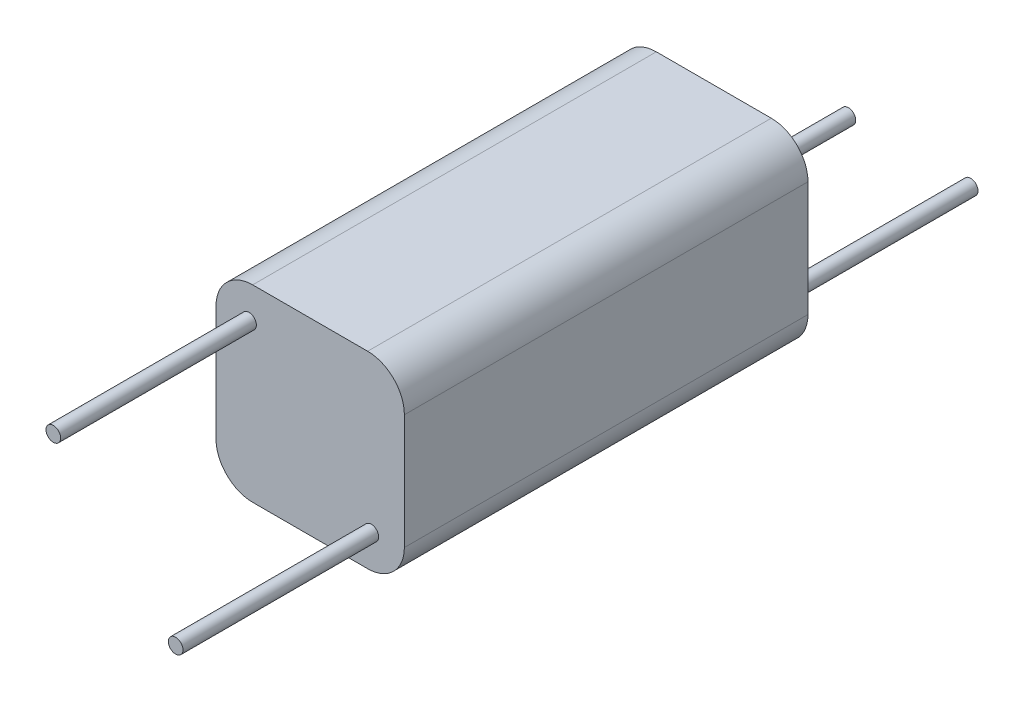
ISO-10303-21;
HEADER;
FILE_DESCRIPTION(('STEP AP214'),'2;1');
FILE_NAME('part.step','',(''),(''),'','','');
FILE_SCHEMA(('AUTOMOTIVE_DESIGN { 1 0 10303 214 1 1 1 1 }'));
ENDSEC;
DATA;
#1=APPLICATION_CONTEXT('core data for automotive mechanical design processes');
#2=APPLICATION_PROTOCOL_DEFINITION('international standard','automotive_design',2000,#1);
#3=PRODUCT_CONTEXT('',#1,'mechanical');
#4=PRODUCT('Part','Part','',(#3));
#5=PRODUCT_RELATED_PRODUCT_CATEGORY('part','',(#4));
#6=PRODUCT_DEFINITION_FORMATION('','',#4);
#7=PRODUCT_DEFINITION_CONTEXT('part definition',#1,'design');
#8=PRODUCT_DEFINITION('design','',#6,#7);
#9=PRODUCT_DEFINITION_SHAPE('','',#8);
#10=(LENGTH_UNIT() NAMED_UNIT(*) SI_UNIT(.MILLI.,.METRE.));
#11=(NAMED_UNIT(*) PLANE_ANGLE_UNIT() SI_UNIT($,.RADIAN.));
#12=(NAMED_UNIT(*) SI_UNIT($,.STERADIAN.) SOLID_ANGLE_UNIT());
#13=UNCERTAINTY_MEASURE_WITH_UNIT(LENGTH_MEASURE(1.E-05),#10,'distance_accuracy_value','');
#14=(GEOMETRIC_REPRESENTATION_CONTEXT(3) GLOBAL_UNCERTAINTY_ASSIGNED_CONTEXT((#13)) GLOBAL_UNIT_ASSIGNED_CONTEXT((#10,
#11,#12)) REPRESENTATION_CONTEXT('',''));
#15=CARTESIAN_POINT('',(0.,0.,0.));
#16=DIRECTION('',(0.,0.,1.));
#17=DIRECTION('',(1.,0.,0.));
#18=AXIS2_PLACEMENT_3D('',#15,#16,#17);
#19=CARTESIAN_POINT('',(-2.35,-2.35,16.5));
#20=DIRECTION('',(0.,0.,1.));
#21=DIRECTION('',(1.,0.,0.));
#22=AXIS2_PLACEMENT_3D('',#19,#20,#21);
#23=PLANE('',#22);
#24=CARTESIAN_POINT('',(2.5,-2.5,16.5));
#25=DIRECTION('',(0.,0.,1.));
#26=DIRECTION('',(1.,0.,0.));
#27=AXIS2_PLACEMENT_3D('',#24,#25,#26);
#28=CIRCLE('',#27,0.3);
#29=CARTESIAN_POINT('',(2.8,-2.5,16.5));
#30=VERTEX_POINT('',#29);
#31=EDGE_CURVE('E244',#30,#30,#28,.T.);
#32=ORIENTED_EDGE('',*,*,#31,.F.);
#33=EDGE_LOOP('',(#32));
#34=FACE_BOUND('',#33,.T.);
#35=CARTESIAN_POINT('',(-2.35,-2.35,16.5));
#36=DIRECTION('',(0.,0.,1.));
#37=DIRECTION('',(1.,0.,0.));
#38=AXIS2_PLACEMENT_3D('',#35,#36,#37);
#39=CIRCLE('',#38,1.5);
#40=CARTESIAN_POINT('',(-3.85,-2.35,16.5));
#41=VERTEX_POINT('',#40);
#42=CARTESIAN_POINT('',(-2.35,-3.85,16.5));
#43=VERTEX_POINT('',#42);
#44=EDGE_CURVE('E146',#41,#43,#39,.T.);
#45=ORIENTED_EDGE('',*,*,#44,.T.);
#46=DIRECTION('',(1.,0.,0.));
#47=VECTOR('',#46,1.);
#48=CARTESIAN_POINT('',(-2.35,-3.85,16.5));
#49=LINE('',#48,#47);
#50=CARTESIAN_POINT('',(2.35,-3.85,16.5));
#51=VERTEX_POINT('',#50);
#52=EDGE_CURVE('E94',#43,#51,#49,.T.);
#53=ORIENTED_EDGE('',*,*,#52,.T.);
#54=CARTESIAN_POINT('',(2.35,-2.35,16.5));
#55=DIRECTION('',(0.,0.,1.));
#56=DIRECTION('',(1.,0.,0.));
#57=AXIS2_PLACEMENT_3D('',#54,#55,#56);
#58=CIRCLE('',#57,1.5);
#59=CARTESIAN_POINT('',(3.85,-2.35,16.5));
#60=VERTEX_POINT('',#59);
#61=EDGE_CURVE('E227',#51,#60,#58,.T.);
#62=ORIENTED_EDGE('',*,*,#61,.T.);
#63=DIRECTION('',(0.,1.,0.));
#64=VECTOR('',#63,1.);
#65=CARTESIAN_POINT('',(3.85,-2.35,16.5));
#66=LINE('',#65,#64);
#67=CARTESIAN_POINT('',(3.85,2.35,16.5));
#68=VERTEX_POINT('',#67);
#69=EDGE_CURVE('E232',#60,#68,#66,.T.);
#70=ORIENTED_EDGE('',*,*,#69,.T.);
#71=CARTESIAN_POINT('',(2.35,2.35,16.5));
#72=DIRECTION('',(0.,0.,1.));
#73=DIRECTION('',(-1.,0.,0.));
#74=AXIS2_PLACEMENT_3D('',#71,#72,#73);
#75=CIRCLE('',#74,1.5);
#76=CARTESIAN_POINT('',(2.35,3.85,16.5));
#77=VERTEX_POINT('',#76);
#78=EDGE_CURVE('E113',#68,#77,#75,.T.);
#79=ORIENTED_EDGE('',*,*,#78,.T.);
#80=DIRECTION('',(-1.,0.,0.));
#81=VECTOR('',#80,1.);
#82=CARTESIAN_POINT('',(-2.35,3.85,16.5));
#83=LINE('',#82,#81);
#84=CARTESIAN_POINT('',(-2.35,3.85,16.5));
#85=VERTEX_POINT('',#84);
#86=EDGE_CURVE('E107',#77,#85,#83,.T.);
#87=ORIENTED_EDGE('',*,*,#86,.T.);
#88=CARTESIAN_POINT('',(-2.35,2.35,16.5));
#89=DIRECTION('',(0.,0.,1.));
#90=DIRECTION('',(1.,0.,0.));
#91=AXIS2_PLACEMENT_3D('',#88,#89,#90);
#92=CIRCLE('',#91,1.5);
#93=CARTESIAN_POINT('',(-3.85,2.35,16.5));
#94=VERTEX_POINT('',#93);
#95=EDGE_CURVE('E111',#85,#94,#92,.T.);
#96=ORIENTED_EDGE('',*,*,#95,.T.);
#97=DIRECTION('',(0.,-1.,0.));
#98=VECTOR('',#97,1.);
#99=CARTESIAN_POINT('',(-3.85,-2.35,16.5));
#100=LINE('',#99,#98);
#101=EDGE_CURVE('E50',#94,#41,#100,.T.);
#102=ORIENTED_EDGE('',*,*,#101,.T.);
#103=EDGE_LOOP('',(#45,#53,#62,#70,#79,#87,#96,#102));
#104=FACE_BOUND('',#103,.T.);
#105=CARTESIAN_POINT('',(-2.5,2.5,16.5));
#106=DIRECTION('',(0.,0.,1.));
#107=DIRECTION('',(1.,0.,0.));
#108=AXIS2_PLACEMENT_3D('',#105,#106,#107);
#109=CIRCLE('',#108,0.3);
#110=CARTESIAN_POINT('',(-2.2,2.5,16.5));
#111=VERTEX_POINT('',#110);
#112=EDGE_CURVE('E250',#111,#111,#109,.T.);
#113=ORIENTED_EDGE('',*,*,#112,.F.);
#114=EDGE_LOOP('',(#113));
#115=FACE_BOUND('',#114,.T.);
#116=ADVANCED_FACE('F33',(#34,#104,#115),#23,.T.);
#117=CARTESIAN_POINT('',(-2.35,-2.35,0.));
#118=DIRECTION('',(0.,0.,1.));
#119=DIRECTION('',(1.,0.,0.));
#120=AXIS2_PLACEMENT_3D('',#117,#118,#119);
#121=PLANE('',#120);
#122=CARTESIAN_POINT('',(2.5,-2.5,0.));
#123=DIRECTION('',(0.,0.,1.));
#124=DIRECTION('',(1.,0.,0.));
#125=AXIS2_PLACEMENT_3D('',#122,#123,#124);
#126=CIRCLE('',#125,0.3);
#127=CARTESIAN_POINT('',(2.8,-2.5,0.));
#128=VERTEX_POINT('',#127);
#129=EDGE_CURVE('E42',#128,#128,#126,.F.);
#130=ORIENTED_EDGE('',*,*,#129,.F.);
#131=EDGE_LOOP('',(#130));
#132=FACE_BOUND('',#131,.T.);
#133=CARTESIAN_POINT('',(-2.35,-2.35,0.));
#134=DIRECTION('',(0.,0.,1.));
#135=DIRECTION('',(1.,0.,0.));
#136=AXIS2_PLACEMENT_3D('',#133,#134,#135);
#137=CIRCLE('',#136,1.5);
#138=CARTESIAN_POINT('',(-3.85,-2.35,0.));
#139=VERTEX_POINT('',#138);
#140=CARTESIAN_POINT('',(-2.35,-3.85,0.));
#141=VERTEX_POINT('',#140);
#142=EDGE_CURVE('E131',#139,#141,#137,.T.);
#143=ORIENTED_EDGE('',*,*,#142,.F.);
#144=DIRECTION('',(0.,-1.,0.));
#145=VECTOR('',#144,1.);
#146=CARTESIAN_POINT('',(-3.85,-2.35,0.));
#147=LINE('',#146,#145);
#148=CARTESIAN_POINT('',(-3.85,2.35,0.));
#149=VERTEX_POINT('',#148);
#150=EDGE_CURVE('E85',#149,#139,#147,.T.);
#151=ORIENTED_EDGE('',*,*,#150,.F.);
#152=CARTESIAN_POINT('',(-2.35,2.35,0.));
#153=DIRECTION('',(0.,0.,1.));
#154=DIRECTION('',(1.,0.,0.));
#155=AXIS2_PLACEMENT_3D('',#152,#153,#154);
#156=CIRCLE('',#155,1.5);
#157=CARTESIAN_POINT('',(-2.35,3.85,0.));
#158=VERTEX_POINT('',#157);
#159=EDGE_CURVE('E79',#158,#149,#156,.T.);
#160=ORIENTED_EDGE('',*,*,#159,.F.);
#161=DIRECTION('',(-1.,0.,0.));
#162=VECTOR('',#161,1.);
#163=CARTESIAN_POINT('',(-2.35,3.85,0.));
#164=LINE('',#163,#162);
#165=CARTESIAN_POINT('',(2.35,3.85,0.));
#166=VERTEX_POINT('',#165);
#167=EDGE_CURVE('E121',#166,#158,#164,.T.);
#168=ORIENTED_EDGE('',*,*,#167,.F.);
#169=CARTESIAN_POINT('',(2.35,2.35,0.));
#170=DIRECTION('',(0.,0.,1.));
#171=DIRECTION('',(-1.,0.,0.));
#172=AXIS2_PLACEMENT_3D('',#169,#170,#171);
#173=CIRCLE('',#172,1.5);
#174=CARTESIAN_POINT('',(3.85,2.35,0.));
#175=VERTEX_POINT('',#174);
#176=EDGE_CURVE('E141',#175,#166,#173,.T.);
#177=ORIENTED_EDGE('',*,*,#176,.F.);
#178=DIRECTION('',(0.,1.,0.));
#179=VECTOR('',#178,1.);
#180=CARTESIAN_POINT('',(3.85,-2.35,0.));
#181=LINE('',#180,#179);
#182=CARTESIAN_POINT('',(3.85,-2.35,0.));
#183=VERTEX_POINT('',#182);
#184=EDGE_CURVE('E139',#183,#175,#181,.T.);
#185=ORIENTED_EDGE('',*,*,#184,.F.);
#186=CARTESIAN_POINT('',(2.35,-2.35,0.));
#187=DIRECTION('',(0.,0.,1.));
#188=DIRECTION('',(1.,0.,0.));
#189=AXIS2_PLACEMENT_3D('',#186,#187,#188);
#190=CIRCLE('',#189,1.5);
#191=CARTESIAN_POINT('',(2.35,-3.85,0.));
#192=VERTEX_POINT('',#191);
#193=EDGE_CURVE('E137',#192,#183,#190,.T.);
#194=ORIENTED_EDGE('',*,*,#193,.F.);
#195=DIRECTION('',(1.,0.,0.));
#196=VECTOR('',#195,1.);
#197=CARTESIAN_POINT('',(-2.35,-3.85,0.));
#198=LINE('',#197,#196);
#199=EDGE_CURVE('E134',#141,#192,#198,.T.);
#200=ORIENTED_EDGE('',*,*,#199,.F.);
#201=EDGE_LOOP('',(#143,#151,#160,#168,#177,#185,#194,#200));
#202=FACE_BOUND('',#201,.T.);
#203=CARTESIAN_POINT('',(-2.5,-2.5,0.));
#204=DIRECTION('',(0.,0.,1.));
#205=DIRECTION('',(1.,0.,0.));
#206=AXIS2_PLACEMENT_3D('',#203,#204,#205);
#207=CIRCLE('',#206,0.3);
#208=CARTESIAN_POINT('',(-2.2,-2.5,0.));
#209=VERTEX_POINT('',#208);
#210=EDGE_CURVE('E11',#209,#209,#207,.F.);
#211=ORIENTED_EDGE('',*,*,#210,.F.);
#212=EDGE_LOOP('',(#211));
#213=FACE_BOUND('',#212,.T.);
#214=ADVANCED_FACE('F165',(#132,#202,#213),#121,.F.);
#215=CARTESIAN_POINT('',(-2.35,-2.35,16.5));
#216=DIRECTION('',(0.,0.,-1.));
#217=DIRECTION('',(-1.,0.,0.));
#218=AXIS2_PLACEMENT_3D('',#215,#216,#217);
#219=CYLINDRICAL_SURFACE('',#218,1.5);
#220=ORIENTED_EDGE('',*,*,#142,.T.);
#221=DIRECTION('',(0.,0.,-1.));
#222=VECTOR('',#221,1.);
#223=CARTESIAN_POINT('',(-2.35,-3.85,16.5));
#224=LINE('',#223,#222);
#225=EDGE_CURVE('E159',#43,#141,#224,.T.);
#226=ORIENTED_EDGE('',*,*,#225,.F.);
#227=ORIENTED_EDGE('',*,*,#44,.F.);
#228=DIRECTION('',(0.,0.,-1.));
#229=VECTOR('',#228,1.);
#230=CARTESIAN_POINT('',(-3.85,-2.35,16.5));
#231=LINE('',#230,#229);
#232=EDGE_CURVE('E127',#41,#139,#231,.T.);
#233=ORIENTED_EDGE('',*,*,#232,.T.);
#234=EDGE_LOOP('',(#220,#226,#227,#233));
#235=FACE_BOUND('',#234,.T.);
#236=ADVANCED_FACE('F35',(#235),#219,.T.);
#237=CARTESIAN_POINT('',(-2.35,-3.85,16.5));
#238=DIRECTION('',(0.,1.,0.));
#239=DIRECTION('',(0.,0.,1.));
#240=AXIS2_PLACEMENT_3D('',#237,#238,#239);
#241=PLANE('',#240);
#242=ORIENTED_EDGE('',*,*,#199,.T.);
#243=DIRECTION('',(0.,0.,-1.));
#244=VECTOR('',#243,1.);
#245=CARTESIAN_POINT('',(2.35,-3.85,16.5));
#246=LINE('',#245,#244);
#247=EDGE_CURVE('E156',#51,#192,#246,.T.);
#248=ORIENTED_EDGE('',*,*,#247,.F.);
#249=ORIENTED_EDGE('',*,*,#52,.F.);
#250=ORIENTED_EDGE('',*,*,#225,.T.);
#251=EDGE_LOOP('',(#242,#248,#249,#250));
#252=FACE_BOUND('',#251,.T.);
#253=ADVANCED_FACE('F216',(#252),#241,.F.);
#254=CARTESIAN_POINT('',(2.35,-2.35,16.5));
#255=DIRECTION('',(0.,0.,-1.));
#256=DIRECTION('',(-1.,0.,0.));
#257=AXIS2_PLACEMENT_3D('',#254,#255,#256);
#258=CYLINDRICAL_SURFACE('',#257,1.5);
#259=ORIENTED_EDGE('',*,*,#193,.T.);
#260=DIRECTION('',(0.,0.,-1.));
#261=VECTOR('',#260,1.);
#262=CARTESIAN_POINT('',(3.85,-2.35,16.5));
#263=LINE('',#262,#261);
#264=EDGE_CURVE('E153',#60,#183,#263,.T.);
#265=ORIENTED_EDGE('',*,*,#264,.F.);
#266=ORIENTED_EDGE('',*,*,#61,.F.);
#267=ORIENTED_EDGE('',*,*,#247,.T.);
#268=EDGE_LOOP('',(#259,#265,#266,#267));
#269=FACE_BOUND('',#268,.T.);
#270=ADVANCED_FACE('F213',(#269),#258,.T.);
#271=CARTESIAN_POINT('',(3.85,-2.35,16.5));
#272=DIRECTION('',(-1.,0.,0.));
#273=DIRECTION('',(0.,0.,1.));
#274=AXIS2_PLACEMENT_3D('',#271,#272,#273);
#275=PLANE('',#274);
#276=ORIENTED_EDGE('',*,*,#184,.T.);
#277=DIRECTION('',(0.,0.,-1.));
#278=VECTOR('',#277,1.);
#279=CARTESIAN_POINT('',(3.85,2.35,16.5));
#280=LINE('',#279,#278);
#281=EDGE_CURVE('E150',#68,#175,#280,.T.);
#282=ORIENTED_EDGE('',*,*,#281,.F.);
#283=ORIENTED_EDGE('',*,*,#69,.F.);
#284=ORIENTED_EDGE('',*,*,#264,.T.);
#285=EDGE_LOOP('',(#276,#282,#283,#284));
#286=FACE_BOUND('',#285,.T.);
#287=ADVANCED_FACE('F209',(#286),#275,.F.);
#288=CARTESIAN_POINT('',(2.35,2.35,16.5));
#289=DIRECTION('',(0.,0.,-1.));
#290=DIRECTION('',(-1.,0.,0.));
#291=AXIS2_PLACEMENT_3D('',#288,#289,#290);
#292=CYLINDRICAL_SURFACE('',#291,1.5);
#293=ORIENTED_EDGE('',*,*,#176,.T.);
#294=DIRECTION('',(0.,0.,-1.));
#295=VECTOR('',#294,1.);
#296=CARTESIAN_POINT('',(2.35,3.85,16.5));
#297=LINE('',#296,#295);
#298=EDGE_CURVE('E122',#77,#166,#297,.T.);
#299=ORIENTED_EDGE('',*,*,#298,.F.);
#300=ORIENTED_EDGE('',*,*,#78,.F.);
#301=ORIENTED_EDGE('',*,*,#281,.T.);
#302=EDGE_LOOP('',(#293,#299,#300,#301));
#303=FACE_BOUND('',#302,.T.);
#304=ADVANCED_FACE('F206',(#303),#292,.T.);
#305=CARTESIAN_POINT('',(-2.35,3.85,16.5));
#306=DIRECTION('',(0.,-1.,0.));
#307=DIRECTION('',(0.,0.,-1.));
#308=AXIS2_PLACEMENT_3D('',#305,#306,#307);
#309=PLANE('',#308);
#310=ORIENTED_EDGE('',*,*,#167,.T.);
#311=DIRECTION('',(0.,0.,-1.));
#312=VECTOR('',#311,1.);
#313=CARTESIAN_POINT('',(-2.35,3.85,16.5));
#314=LINE('',#313,#312);
#315=EDGE_CURVE('E118',#85,#158,#314,.T.);
#316=ORIENTED_EDGE('',*,*,#315,.F.);
#317=ORIENTED_EDGE('',*,*,#86,.F.);
#318=ORIENTED_EDGE('',*,*,#298,.T.);
#319=EDGE_LOOP('',(#310,#316,#317,#318));
#320=FACE_BOUND('',#319,.T.);
#321=ADVANCED_FACE('F119',(#320),#309,.F.);
#322=CARTESIAN_POINT('',(-2.35,2.35,16.5));
#323=DIRECTION('',(0.,0.,-1.));
#324=DIRECTION('',(-1.,0.,0.));
#325=AXIS2_PLACEMENT_3D('',#322,#323,#324);
#326=CYLINDRICAL_SURFACE('',#325,1.5);
#327=ORIENTED_EDGE('',*,*,#159,.T.);
#328=DIRECTION('',(0.,0.,-1.));
#329=VECTOR('',#328,1.);
#330=CARTESIAN_POINT('',(-3.85,2.35,16.5));
#331=LINE('',#330,#329);
#332=EDGE_CURVE('E123',#94,#149,#331,.T.);
#333=ORIENTED_EDGE('',*,*,#332,.F.);
#334=ORIENTED_EDGE('',*,*,#95,.F.);
#335=ORIENTED_EDGE('',*,*,#315,.T.);
#336=EDGE_LOOP('',(#327,#333,#334,#335));
#337=FACE_BOUND('',#336,.T.);
#338=ADVANCED_FACE('F125',(#337),#326,.T.);
#339=CARTESIAN_POINT('',(-3.85,-2.35,16.5));
#340=DIRECTION('',(1.,0.,0.));
#341=DIRECTION('',(0.,0.,-1.));
#342=AXIS2_PLACEMENT_3D('',#339,#340,#341);
#343=PLANE('',#342);
#344=ORIENTED_EDGE('',*,*,#150,.T.);
#345=ORIENTED_EDGE('',*,*,#232,.F.);
#346=ORIENTED_EDGE('',*,*,#101,.F.);
#347=ORIENTED_EDGE('',*,*,#332,.T.);
#348=EDGE_LOOP('',(#344,#345,#346,#347));
#349=FACE_BOUND('',#348,.T.);
#350=ADVANCED_FACE('F199',(#349),#343,.F.);
#351=CARTESIAN_POINT('',(2.5,-2.5,-8.));
#352=DIRECTION('',(0.,0.,1.));
#353=DIRECTION('',(1.,0.,0.));
#354=AXIS2_PLACEMENT_3D('',#351,#352,#353);
#355=CYLINDRICAL_SURFACE('',#354,0.3);
#356=CARTESIAN_POINT('',(2.5,-2.5,-8.));
#357=DIRECTION('',(0.,0.,-1.));
#358=DIRECTION('',(-1.,0.,0.));
#359=AXIS2_PLACEMENT_3D('',#356,#357,#358);
#360=CIRCLE('',#359,0.3);
#361=CARTESIAN_POINT('',(2.2,-2.5,-8.));
#362=VERTEX_POINT('',#361);
#363=EDGE_CURVE('E135',#362,#362,#360,.T.);
#364=ORIENTED_EDGE('',*,*,#363,.F.);
#365=EDGE_LOOP('',(#364));
#366=FACE_BOUND('',#365,.T.);
#367=ORIENTED_EDGE('',*,*,#129,.T.);
#368=EDGE_LOOP('',(#367));
#369=FACE_BOUND('',#368,.T.);
#370=ADVANCED_FACE('F163',(#366,#369),#355,.T.);
#371=CARTESIAN_POINT('',(2.5,-2.5,-8.));
#372=DIRECTION('',(0.,0.,-1.));
#373=DIRECTION('',(-1.,0.,0.));
#374=AXIS2_PLACEMENT_3D('',#371,#372,#373);
#375=PLANE('',#374);
#376=ORIENTED_EDGE('',*,*,#363,.T.);
#377=EDGE_LOOP('',(#376));
#378=FACE_BOUND('',#377,.T.);
#379=ADVANCED_FACE('F176',(#378),#375,.T.);
#380=CARTESIAN_POINT('',(-2.5,-2.5,-8.));
#381=DIRECTION('',(0.,0.,1.));
#382=DIRECTION('',(1.,0.,0.));
#383=AXIS2_PLACEMENT_3D('',#380,#381,#382);
#384=CYLINDRICAL_SURFACE('',#383,0.3);
#385=CARTESIAN_POINT('',(-2.5,-2.5,-8.));
#386=DIRECTION('',(0.,0.,-1.));
#387=DIRECTION('',(-1.,0.,0.));
#388=AXIS2_PLACEMENT_3D('',#385,#386,#387);
#389=CIRCLE('',#388,0.3);
#390=CARTESIAN_POINT('',(-2.8,-2.5,-8.));
#391=VERTEX_POINT('',#390);
#392=EDGE_CURVE('E240',#391,#391,#389,.T.);
#393=ORIENTED_EDGE('',*,*,#392,.F.);
#394=EDGE_LOOP('',(#393));
#395=FACE_BOUND('',#394,.T.);
#396=ORIENTED_EDGE('',*,*,#210,.T.);
#397=EDGE_LOOP('',(#396));
#398=FACE_BOUND('',#397,.T.);
#399=ADVANCED_FACE('F173',(#395,#398),#384,.T.);
#400=CARTESIAN_POINT('',(-2.5,-2.5,-8.));
#401=DIRECTION('',(0.,0.,-1.));
#402=DIRECTION('',(-1.,0.,0.));
#403=AXIS2_PLACEMENT_3D('',#400,#401,#402);
#404=PLANE('',#403);
#405=ORIENTED_EDGE('',*,*,#392,.T.);
#406=EDGE_LOOP('',(#405));
#407=FACE_BOUND('',#406,.T.);
#408=ADVANCED_FACE('F175',(#407),#404,.T.);
#409=CARTESIAN_POINT('',(2.5,-2.5,24.5));
#410=DIRECTION('',(0.,0.,-1.));
#411=DIRECTION('',(-1.,0.,0.));
#412=AXIS2_PLACEMENT_3D('',#409,#410,#411);
#413=CYLINDRICAL_SURFACE('',#412,0.3);
#414=CARTESIAN_POINT('',(2.5,-2.5,24.5));
#415=DIRECTION('',(0.,0.,1.));
#416=DIRECTION('',(1.,0.,0.));
#417=AXIS2_PLACEMENT_3D('',#414,#415,#416);
#418=CIRCLE('',#417,0.3);
#419=CARTESIAN_POINT('',(2.8,-2.5,24.5));
#420=VERTEX_POINT('',#419);
#421=EDGE_CURVE('E243',#420,#420,#418,.T.);
#422=ORIENTED_EDGE('',*,*,#421,.F.);
#423=EDGE_LOOP('',(#422));
#424=FACE_BOUND('',#423,.T.);
#425=ORIENTED_EDGE('',*,*,#31,.T.);
#426=EDGE_LOOP('',(#425));
#427=FACE_BOUND('',#426,.T.);
#428=ADVANCED_FACE('F183',(#424,#427),#413,.T.);
#429=CARTESIAN_POINT('',(2.5,-2.5,24.5));
#430=DIRECTION('',(0.,0.,1.));
#431=DIRECTION('',(1.,0.,0.));
#432=AXIS2_PLACEMENT_3D('',#429,#430,#431);
#433=PLANE('',#432);
#434=ORIENTED_EDGE('',*,*,#421,.T.);
#435=EDGE_LOOP('',(#434));
#436=FACE_BOUND('',#435,.T.);
#437=ADVANCED_FACE('F261',(#436),#433,.T.);
#438=CARTESIAN_POINT('',(-2.5,2.5,24.5));
#439=DIRECTION('',(0.,0.,-1.));
#440=DIRECTION('',(-1.,0.,0.));
#441=AXIS2_PLACEMENT_3D('',#438,#439,#440);
#442=CYLINDRICAL_SURFACE('',#441,0.3);
#443=CARTESIAN_POINT('',(-2.5,2.5,24.5));
#444=DIRECTION('',(0.,0.,1.));
#445=DIRECTION('',(1.,0.,0.));
#446=AXIS2_PLACEMENT_3D('',#443,#444,#445);
#447=CIRCLE('',#446,0.3);
#448=CARTESIAN_POINT('',(-2.2,2.5,24.5));
#449=VERTEX_POINT('',#448);
#450=EDGE_CURVE('E247',#449,#449,#447,.T.);
#451=ORIENTED_EDGE('',*,*,#450,.F.);
#452=EDGE_LOOP('',(#451));
#453=FACE_BOUND('',#452,.T.);
#454=ORIENTED_EDGE('',*,*,#112,.T.);
#455=EDGE_LOOP('',(#454));
#456=FACE_BOUND('',#455,.T.);
#457=ADVANCED_FACE('F258',(#453,#456),#442,.T.);
#458=CARTESIAN_POINT('',(-2.5,2.5,24.5));
#459=DIRECTION('',(0.,0.,1.));
#460=DIRECTION('',(1.,0.,0.));
#461=AXIS2_PLACEMENT_3D('',#458,#459,#460);
#462=PLANE('',#461);
#463=ORIENTED_EDGE('',*,*,#450,.T.);
#464=EDGE_LOOP('',(#463));
#465=FACE_BOUND('',#464,.T.);
#466=ADVANCED_FACE('F256',(#465),#462,.T.);
#467=CLOSED_SHELL('',(#116,#214,#236,#253,#270,#287,#304,#321,#338,#350,#370,#379,#399,#408,
#428,#437,#457,#466));
#468=MANIFOLD_SOLID_BREP('B2',#467);
#469=ADVANCED_BREP_SHAPE_REPRESENTATION('',(#18,#468),#14);
#470=SHAPE_DEFINITION_REPRESENTATION(#9,#469);
ENDSEC;
END-ISO-10303-21;
